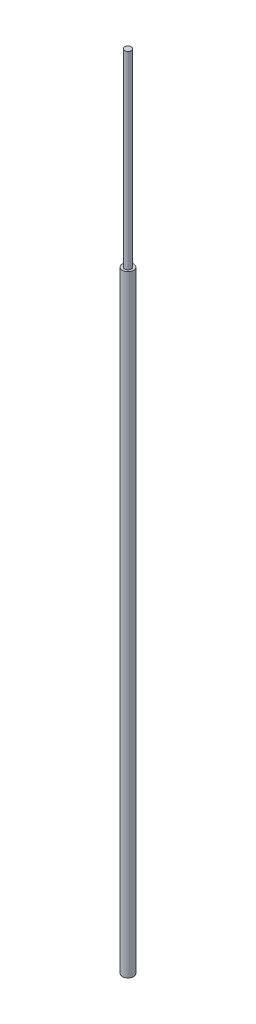
ISO-10303-21;
HEADER;
FILE_DESCRIPTION(('STEP AP214'),'2;1');
FILE_NAME('part.step','',(''),(''),'','','');
FILE_SCHEMA(('AUTOMOTIVE_DESIGN { 1 0 10303 214 1 1 1 1 }'));
ENDSEC;
DATA;
#1=APPLICATION_CONTEXT('core data for automotive mechanical design processes');
#2=APPLICATION_PROTOCOL_DEFINITION('international standard','automotive_design',2000,#1);
#3=PRODUCT_CONTEXT('',#1,'mechanical');
#4=PRODUCT('Part','Part','',(#3));
#5=PRODUCT_RELATED_PRODUCT_CATEGORY('part','',(#4));
#6=PRODUCT_DEFINITION_FORMATION('','',#4);
#7=PRODUCT_DEFINITION_CONTEXT('part definition',#1,'design');
#8=PRODUCT_DEFINITION('design','',#6,#7);
#9=PRODUCT_DEFINITION_SHAPE('','',#8);
#10=(LENGTH_UNIT() NAMED_UNIT(*) SI_UNIT(.MILLI.,.METRE.));
#11=(NAMED_UNIT(*) PLANE_ANGLE_UNIT() SI_UNIT($,.RADIAN.));
#12=(NAMED_UNIT(*) SI_UNIT($,.STERADIAN.) SOLID_ANGLE_UNIT());
#13=UNCERTAINTY_MEASURE_WITH_UNIT(LENGTH_MEASURE(1.E-05),#10,'distance_accuracy_value','');
#14=(GEOMETRIC_REPRESENTATION_CONTEXT(3) GLOBAL_UNCERTAINTY_ASSIGNED_CONTEXT((#13)) GLOBAL_UNIT_ASSIGNED_CONTEXT((#10,
#11,#12)) REPRESENTATION_CONTEXT('',''));
#15=CARTESIAN_POINT('',(0.,0.,0.));
#16=DIRECTION('',(0.,0.,1.));
#17=DIRECTION('',(1.,0.,0.));
#18=AXIS2_PLACEMENT_3D('',#15,#16,#17);
#19=CARTESIAN_POINT('',(0.,1397.,0.));
#20=DIRECTION('',(0.,-1.,0.));
#21=DIRECTION('',(0.,0.,-1.));
#22=AXIS2_PLACEMENT_3D('',#19,#20,#21);
#23=CYLINDRICAL_SURFACE('',#22,12.7);
#24=CARTESIAN_POINT('',(0.,1397.,0.));
#25=DIRECTION('',(0.,1.,0.));
#26=DIRECTION('',(0.,0.,1.));
#27=AXIS2_PLACEMENT_3D('',#24,#25,#26);
#28=CIRCLE('',#27,12.7);
#29=CARTESIAN_POINT('',(0.,1397.,12.7));
#30=VERTEX_POINT('',#29);
#31=EDGE_CURVE('E41',#30,#30,#28,.T.);
#32=ORIENTED_EDGE('',*,*,#31,.F.);
#33=EDGE_LOOP('',(#32));
#34=FACE_BOUND('',#33,.T.);
#35=CARTESIAN_POINT('',(0.,0.,0.));
#36=DIRECTION('',(0.,1.,0.));
#37=DIRECTION('',(0.,0.,1.));
#38=AXIS2_PLACEMENT_3D('',#35,#36,#37);
#39=CIRCLE('',#38,12.7);
#40=CARTESIAN_POINT('',(0.,0.,12.7));
#41=VERTEX_POINT('',#40);
#42=EDGE_CURVE('E37',#41,#41,#39,.T.);
#43=ORIENTED_EDGE('',*,*,#42,.T.);
#44=EDGE_LOOP('',(#43));
#45=FACE_BOUND('',#44,.T.);
#46=ADVANCED_FACE('F34',(#34,#45),#23,.T.);
#47=CARTESIAN_POINT('',(0.,1397.,0.));
#48=DIRECTION('',(0.,1.,0.));
#49=DIRECTION('',(0.,0.,1.));
#50=AXIS2_PLACEMENT_3D('',#47,#48,#49);
#51=PLANE('',#50);
#52=CARTESIAN_POINT('',(0.,1397.,0.));
#53=DIRECTION('',(0.,1.,0.));
#54=DIRECTION('',(0.,0.,1.));
#55=AXIS2_PLACEMENT_3D('',#52,#53,#54);
#56=CIRCLE('',#55,7.63699225690394);
#57=CARTESIAN_POINT('',(0.,1397.,7.63699225690394));
#58=VERTEX_POINT('',#57);
#59=EDGE_CURVE('E10',#58,#58,#56,.T.);
#60=ORIENTED_EDGE('',*,*,#59,.F.);
#61=EDGE_LOOP('',(#60));
#62=FACE_BOUND('',#61,.T.);
#63=ORIENTED_EDGE('',*,*,#31,.T.);
#64=EDGE_LOOP('',(#63));
#65=FACE_BOUND('',#64,.T.);
#66=ADVANCED_FACE('F58',(#62,#65),#51,.T.);
#67=CARTESIAN_POINT('',(0.,0.,0.));
#68=DIRECTION('',(0.,1.,0.));
#69=DIRECTION('',(0.,0.,1.));
#70=AXIS2_PLACEMENT_3D('',#67,#68,#69);
#71=PLANE('',#70);
#72=ORIENTED_EDGE('',*,*,#42,.F.);
#73=EDGE_LOOP('',(#72));
#74=FACE_BOUND('',#73,.T.);
#75=ADVANCED_FACE('F55',(#74),#71,.F.);
#76=CARTESIAN_POINT('',(0.,1828.8,0.));
#77=DIRECTION('',(0.,-1.,0.));
#78=DIRECTION('',(0.,0.,-1.));
#79=AXIS2_PLACEMENT_3D('',#76,#77,#78);
#80=CYLINDRICAL_SURFACE('',#79,7.63699225690394);
#81=CARTESIAN_POINT('',(0.,1828.8,0.));
#82=DIRECTION('',(0.,1.,0.));
#83=DIRECTION('',(0.,0.,1.));
#84=AXIS2_PLACEMENT_3D('',#81,#82,#83);
#85=CIRCLE('',#84,7.63699225690394);
#86=CARTESIAN_POINT('',(0.,1828.8,7.63699225690394));
#87=VERTEX_POINT('',#86);
#88=EDGE_CURVE('E47',#87,#87,#85,.T.);
#89=ORIENTED_EDGE('',*,*,#88,.F.);
#90=EDGE_LOOP('',(#89));
#91=FACE_BOUND('',#90,.T.);
#92=ORIENTED_EDGE('',*,*,#59,.T.);
#93=EDGE_LOOP('',(#92));
#94=FACE_BOUND('',#93,.T.);
#95=ADVANCED_FACE('F57',(#91,#94),#80,.T.);
#96=CARTESIAN_POINT('',(0.,1828.8,0.));
#97=DIRECTION('',(0.,1.,0.));
#98=DIRECTION('',(0.,0.,1.));
#99=AXIS2_PLACEMENT_3D('',#96,#97,#98);
#100=PLANE('',#99);
#101=ORIENTED_EDGE('',*,*,#88,.T.);
#102=EDGE_LOOP('',(#101));
#103=FACE_BOUND('',#102,.T.);
#104=ADVANCED_FACE('F63',(#103),#100,.T.);
#105=CLOSED_SHELL('',(#46,#66,#75,#95,#104));
#106=MANIFOLD_SOLID_BREP('B2',#105);
#107=ADVANCED_BREP_SHAPE_REPRESENTATION('',(#18,#106),#14);
#108=SHAPE_DEFINITION_REPRESENTATION(#9,#107);
ENDSEC;
END-ISO-10303-21;
